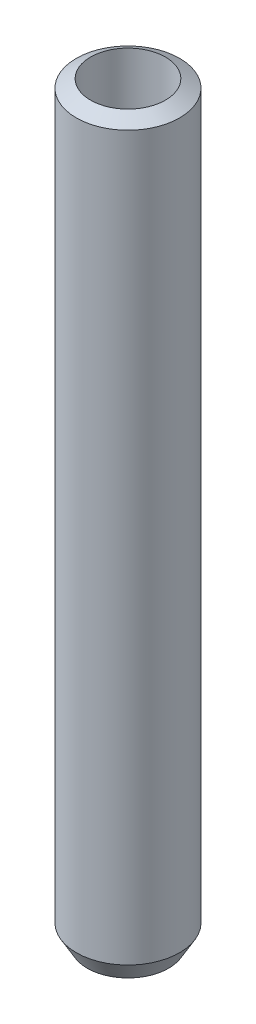
ISO-10303-21;
HEADER;
FILE_DESCRIPTION(('STEP AP214'),'2;1');
FILE_NAME('part.step','',(''),(''),'','','');
FILE_SCHEMA(('AUTOMOTIVE_DESIGN { 1 0 10303 214 1 1 1 1 }'));
ENDSEC;
DATA;
#1=APPLICATION_CONTEXT('core data for automotive mechanical design processes');
#2=APPLICATION_PROTOCOL_DEFINITION('international standard','automotive_design',2000,#1);
#3=PRODUCT_CONTEXT('',#1,'mechanical');
#4=PRODUCT('Part','Part','',(#3));
#5=PRODUCT_RELATED_PRODUCT_CATEGORY('part','',(#4));
#6=PRODUCT_DEFINITION_FORMATION('','',#4);
#7=PRODUCT_DEFINITION_CONTEXT('part definition',#1,'design');
#8=PRODUCT_DEFINITION('design','',#6,#7);
#9=PRODUCT_DEFINITION_SHAPE('','',#8);
#10=(LENGTH_UNIT() NAMED_UNIT(*) SI_UNIT(.MILLI.,.METRE.));
#11=(NAMED_UNIT(*) PLANE_ANGLE_UNIT() SI_UNIT($,.RADIAN.));
#12=(NAMED_UNIT(*) SI_UNIT($,.STERADIAN.) SOLID_ANGLE_UNIT());
#13=UNCERTAINTY_MEASURE_WITH_UNIT(LENGTH_MEASURE(1.E-05),#10,'distance_accuracy_value','');
#14=(GEOMETRIC_REPRESENTATION_CONTEXT(3) GLOBAL_UNCERTAINTY_ASSIGNED_CONTEXT((#13)) GLOBAL_UNIT_ASSIGNED_CONTEXT((#10,
#11,#12)) REPRESENTATION_CONTEXT('',''));
#15=CARTESIAN_POINT('',(0.,0.,0.));
#16=DIRECTION('',(0.,0.,1.));
#17=DIRECTION('',(1.,0.,0.));
#18=AXIS2_PLACEMENT_3D('',#15,#16,#17);
#19=CARTESIAN_POINT('',(0.,291.561736673439,0.));
#20=DIRECTION('',(0.,-1.,0.));
#21=DIRECTION('',(0.,0.,-1.));
#22=AXIS2_PLACEMENT_3D('',#19,#20,#21);
#23=CYLINDRICAL_SURFACE('',#22,20.);
#24=CARTESIAN_POINT('',(0.,287.324898425961,0.));
#25=DIRECTION('',(0.,1.,0.));
#26=DIRECTION('',(0.,0.,1.));
#27=AXIS2_PLACEMENT_3D('',#24,#25,#26);
#28=CIRCLE('',#27,20.);
#29=CARTESIAN_POINT('',(0.,287.324898425961,20.));
#30=VERTEX_POINT('',#29);
#31=EDGE_CURVE('E50',#30,#30,#28,.F.);
#32=ORIENTED_EDGE('',*,*,#31,.T.);
#33=EDGE_LOOP('',(#32));
#34=FACE_BOUND('',#33,.T.);
#35=CARTESIAN_POINT('',(0.,7.33841910808264,0.));
#36=DIRECTION('',(0.,1.,0.));
#37=DIRECTION('',(0.,0.,1.));
#38=AXIS2_PLACEMENT_3D('',#35,#36,#37);
#39=CIRCLE('',#38,20.);
#40=CARTESIAN_POINT('',(0.,7.33841910808264,20.));
#41=VERTEX_POINT('',#40);
#42=EDGE_CURVE('E51',#41,#41,#39,.T.);
#43=ORIENTED_EDGE('',*,*,#42,.T.);
#44=EDGE_LOOP('',(#43));
#45=FACE_BOUND('',#44,.T.);
#46=ADVANCED_FACE('F39',(#34,#45),#23,.T.);
#47=CARTESIAN_POINT('',(0.,0.,0.));
#48=DIRECTION('',(0.,1.,0.));
#49=DIRECTION('',(0.,0.,1.));
#50=AXIS2_PLACEMENT_3D('',#47,#48,#49);
#51=PLANE('',#50);
#52=CARTESIAN_POINT('',(0.,0.,0.));
#53=DIRECTION('',(0.,1.,0.));
#54=DIRECTION('',(0.,0.,1.));
#55=AXIS2_PLACEMENT_3D('',#52,#53,#54);
#56=CIRCLE('',#55,15.7631617525221);
#57=CARTESIAN_POINT('',(0.,0.,15.7631617525221));
#58=VERTEX_POINT('',#57);
#59=EDGE_CURVE('E10',#58,#58,#56,.F.);
#60=ORIENTED_EDGE('',*,*,#59,.T.);
#61=EDGE_LOOP('',(#60));
#62=FACE_BOUND('',#61,.T.);
#63=CARTESIAN_POINT('',(0.,0.,0.));
#64=DIRECTION('',(0.,1.,0.));
#65=DIRECTION('',(0.,0.,1.));
#66=AXIS2_PLACEMENT_3D('',#63,#64,#65);
#67=CIRCLE('',#66,14.4874552401024);
#68=CARTESIAN_POINT('',(0.,0.,14.4874552401024));
#69=VERTEX_POINT('',#68);
#70=EDGE_CURVE('E58',#69,#69,#67,.T.);
#71=ORIENTED_EDGE('',*,*,#70,.T.);
#72=EDGE_LOOP('',(#71));
#73=FACE_BOUND('',#72,.T.);
#74=ADVANCED_FACE('F62',(#62,#73),#51,.F.);
#75=CARTESIAN_POINT('',(0.,291.561736673439,0.));
#76=DIRECTION('',(0.,-1.,0.));
#77=DIRECTION('',(0.,0.,-1.));
#78=AXIS2_PLACEMENT_3D('',#75,#76,#77);
#79=CYLINDRICAL_SURFACE('',#78,14.4874552401024);
#80=CARTESIAN_POINT('',(0.,290.507567627008,0.));
#81=DIRECTION('',(0.,-1.,0.));
#82=DIRECTION('',(0.,0.,-1.));
#83=AXIS2_PLACEMENT_3D('',#80,#81,#82);
#84=CIRCLE('',#83,14.4874552401024);
#85=CARTESIAN_POINT('',(0.,290.507567627008,-14.4874552401024));
#86=VERTEX_POINT('',#85);
#87=EDGE_CURVE('E54',#86,#86,#84,.F.);
#88=ORIENTED_EDGE('',*,*,#87,.T.);
#89=EDGE_LOOP('',(#88));
#90=FACE_BOUND('',#89,.T.);
#91=ORIENTED_EDGE('',*,*,#70,.F.);
#92=EDGE_LOOP('',(#91));
#93=FACE_BOUND('',#92,.T.);
#94=ADVANCED_FACE('F68',(#90,#93),#79,.F.);
#95=CARTESIAN_POINT('',(0.,291.561736673439,0.));
#96=DIRECTION('',(0.,-1.,0.));
#97=DIRECTION('',(0.,0.,-1.));
#98=AXIS2_PLACEMENT_3D('',#95,#96,#97);
#99=CONICAL_SURFACE('',#98,12.6615808919173,1.0471975511966);
#100=ORIENTED_EDGE('',*,*,#31,.F.);
#101=EDGE_LOOP('',(#100));
#102=FACE_BOUND('',#101,.T.);
#103=ORIENTED_EDGE('',*,*,#87,.F.);
#104=EDGE_LOOP('',(#103));
#105=FACE_BOUND('',#104,.T.);
#106=ADVANCED_FACE('F66',(#102,#105),#99,.T.);
#107=CARTESIAN_POINT('',(0.,7.33841910808264,0.));
#108=DIRECTION('',(0.,1.,0.));
#109=DIRECTION('',(0.,0.,1.));
#110=AXIS2_PLACEMENT_3D('',#107,#108,#109);
#111=CONICAL_SURFACE('',#110,20.,0.523598775598306);
#112=ORIENTED_EDGE('',*,*,#59,.F.);
#113=EDGE_LOOP('',(#112));
#114=FACE_BOUND('',#113,.T.);
#115=ORIENTED_EDGE('',*,*,#42,.F.);
#116=EDGE_LOOP('',(#115));
#117=FACE_BOUND('',#116,.T.);
#118=ADVANCED_FACE('F45',(#114,#117),#111,.T.);
#119=CLOSED_SHELL('',(#46,#74,#94,#106,#118));
#120=MANIFOLD_SOLID_BREP('B2',#119);
#121=ADVANCED_BREP_SHAPE_REPRESENTATION('',(#18,#120),#14);
#122=SHAPE_DEFINITION_REPRESENTATION(#9,#121);
ENDSEC;
END-ISO-10303-21;
